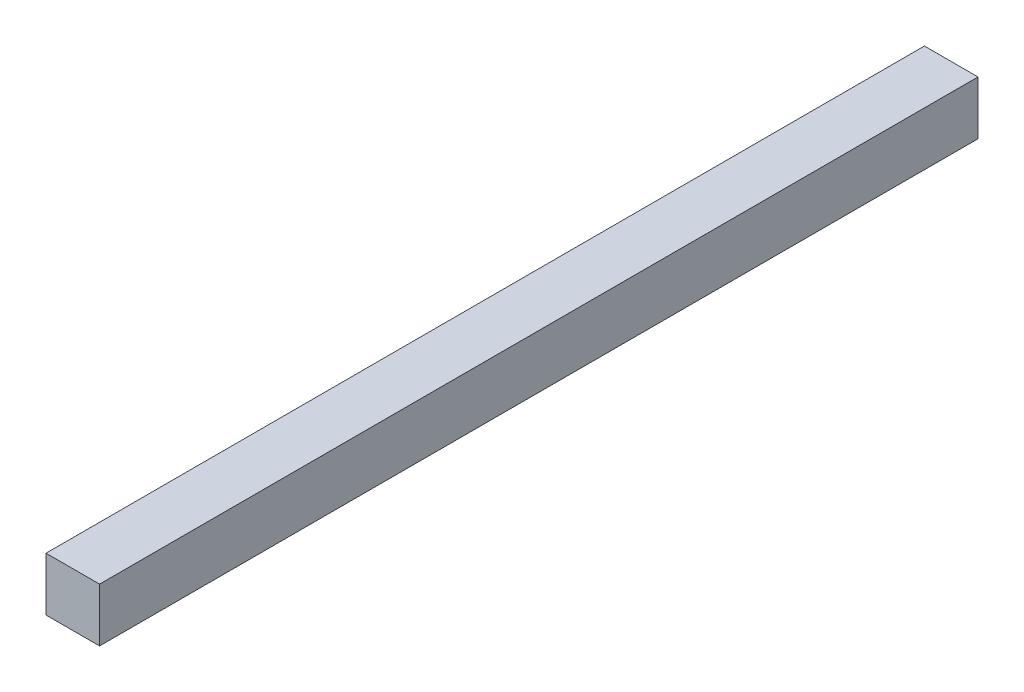
ISO-10303-21;
HEADER;
FILE_DESCRIPTION(('STEP AP214'),'2;1');
FILE_NAME('part.step','',(''),(''),'','','');
FILE_SCHEMA(('AUTOMOTIVE_DESIGN { 1 0 10303 214 1 1 1 1 }'));
ENDSEC;
DATA;
#1=APPLICATION_CONTEXT('core data for automotive mechanical design processes');
#2=APPLICATION_PROTOCOL_DEFINITION('international standard','automotive_design',2000,#1);
#3=PRODUCT_CONTEXT('',#1,'mechanical');
#4=PRODUCT('Part','Part','',(#3));
#5=PRODUCT_RELATED_PRODUCT_CATEGORY('part','',(#4));
#6=PRODUCT_DEFINITION_FORMATION('','',#4);
#7=PRODUCT_DEFINITION_CONTEXT('part definition',#1,'design');
#8=PRODUCT_DEFINITION('design','',#6,#7);
#9=PRODUCT_DEFINITION_SHAPE('','',#8);
#10=(LENGTH_UNIT() NAMED_UNIT(*) SI_UNIT(.MILLI.,.METRE.));
#11=(NAMED_UNIT(*) PLANE_ANGLE_UNIT() SI_UNIT($,.RADIAN.));
#12=(NAMED_UNIT(*) SI_UNIT($,.STERADIAN.) SOLID_ANGLE_UNIT());
#13=UNCERTAINTY_MEASURE_WITH_UNIT(LENGTH_MEASURE(1.E-05),#10,'distance_accuracy_value','');
#14=(GEOMETRIC_REPRESENTATION_CONTEXT(3) GLOBAL_UNCERTAINTY_ASSIGNED_CONTEXT((#13)) GLOBAL_UNIT_ASSIGNED_CONTEXT((#10,
#11,#12)) REPRESENTATION_CONTEXT('',''));
#15=CARTESIAN_POINT('',(0.,0.,0.));
#16=DIRECTION('',(0.,0.,1.));
#17=DIRECTION('',(1.,0.,0.));
#18=AXIS2_PLACEMENT_3D('',#15,#16,#17);
#19=CARTESIAN_POINT('',(0.0254,-0.0254,0.));
#20=DIRECTION('',(-1.,0.,0.));
#21=DIRECTION('',(0.,0.,1.));
#22=AXIS2_PLACEMENT_3D('',#19,#20,#21);
#23=PLANE('',#22);
#24=DIRECTION('',(0.,0.,-1.));
#25=VECTOR('',#24,1.);
#26=CARTESIAN_POINT('',(0.0254,0.,0.));
#27=LINE('',#26,#25);
#28=CARTESIAN_POINT('',(0.0254,0.,0.));
#29=VERTEX_POINT('',#28);
#30=CARTESIAN_POINT('',(0.0254,0.,0.41656));
#31=VERTEX_POINT('',#30);
#32=EDGE_CURVE('E19',#29,#31,#27,.F.);
#33=ORIENTED_EDGE('',*,*,#32,.T.);
#34=DIRECTION('',(0.,1.,0.));
#35=VECTOR('',#34,1.);
#36=CARTESIAN_POINT('',(0.0254,0.,0.41656));
#37=LINE('',#36,#35);
#38=CARTESIAN_POINT('',(0.0254,-0.0254,0.41656));
#39=VERTEX_POINT('',#38);
#40=EDGE_CURVE('E54',#31,#39,#37,.F.);
#41=ORIENTED_EDGE('',*,*,#40,.T.);
#42=DIRECTION('',(0.,0.,1.));
#43=VECTOR('',#42,1.);
#44=CARTESIAN_POINT('',(0.0254,-0.0254,0.));
#45=LINE('',#44,#43);
#46=CARTESIAN_POINT('',(0.0254,-0.0254,0.));
#47=VERTEX_POINT('',#46);
#48=EDGE_CURVE('E75',#39,#47,#45,.F.);
#49=ORIENTED_EDGE('',*,*,#48,.T.);
#50=DIRECTION('',(0.,1.,0.));
#51=VECTOR('',#50,1.);
#52=CARTESIAN_POINT('',(0.0254,0.,0.));
#53=LINE('',#52,#51);
#54=EDGE_CURVE('E57',#29,#47,#53,.F.);
#55=ORIENTED_EDGE('',*,*,#54,.F.);
#56=EDGE_LOOP('',(#33,#41,#49,#55));
#57=FACE_BOUND('',#56,.T.);
#58=ADVANCED_FACE('F16',(#57),#23,.F.);
#59=CARTESIAN_POINT('',(0.0254,0.,0.));
#60=DIRECTION('',(0.,-1.,0.));
#61=DIRECTION('',(0.,0.,-1.));
#62=AXIS2_PLACEMENT_3D('',#59,#60,#61);
#63=PLANE('',#62);
#64=DIRECTION('',(0.,0.,-1.));
#65=VECTOR('',#64,1.);
#66=CARTESIAN_POINT('',(0.,0.,0.));
#67=LINE('',#66,#65);
#68=CARTESIAN_POINT('',(0.,0.,0.));
#69=VERTEX_POINT('',#68);
#70=CARTESIAN_POINT('',(0.,0.,0.41656));
#71=VERTEX_POINT('',#70);
#72=EDGE_CURVE('E72',#69,#71,#67,.F.);
#73=ORIENTED_EDGE('',*,*,#72,.T.);
#74=DIRECTION('',(-1.,0.,0.));
#75=VECTOR('',#74,1.);
#76=CARTESIAN_POINT('',(0.,0.,0.41656));
#77=LINE('',#76,#75);
#78=EDGE_CURVE('E62',#71,#31,#77,.F.);
#79=ORIENTED_EDGE('',*,*,#78,.T.);
#80=ORIENTED_EDGE('',*,*,#32,.F.);
#81=DIRECTION('',(-1.,0.,0.));
#82=VECTOR('',#81,1.);
#83=CARTESIAN_POINT('',(0.,0.,0.));
#84=LINE('',#83,#82);
#85=EDGE_CURVE('E77',#69,#29,#84,.F.);
#86=ORIENTED_EDGE('',*,*,#85,.F.);
#87=EDGE_LOOP('',(#73,#79,#80,#86));
#88=FACE_BOUND('',#87,.T.);
#89=ADVANCED_FACE('F71',(#88),#63,.F.);
#90=CARTESIAN_POINT('',(0.,0.,0.41656));
#91=DIRECTION('',(0.,0.,-1.));
#92=DIRECTION('',(-1.,0.,0.));
#93=AXIS2_PLACEMENT_3D('',#90,#91,#92);
#94=PLANE('',#93);
#95=DIRECTION('',(1.,0.,0.));
#96=VECTOR('',#95,1.);
#97=CARTESIAN_POINT('',(0.,-0.0254,0.41656));
#98=LINE('',#97,#96);
#99=CARTESIAN_POINT('',(0.,-0.0254,0.41656));
#100=VERTEX_POINT('',#99);
#101=EDGE_CURVE('E68',#100,#39,#98,.T.);
#102=ORIENTED_EDGE('',*,*,#101,.T.);
#103=ORIENTED_EDGE('',*,*,#40,.F.);
#104=ORIENTED_EDGE('',*,*,#78,.F.);
#105=DIRECTION('',(0.,1.,0.));
#106=VECTOR('',#105,1.);
#107=CARTESIAN_POINT('',(0.,0.,0.41656));
#108=LINE('',#107,#106);
#109=EDGE_CURVE('E82',#71,#100,#108,.F.);
#110=ORIENTED_EDGE('',*,*,#109,.T.);
#111=EDGE_LOOP('',(#102,#103,#104,#110));
#112=FACE_BOUND('',#111,.T.);
#113=ADVANCED_FACE('F65',(#112),#94,.F.);
#114=CARTESIAN_POINT('',(0.,-0.0254,0.));
#115=DIRECTION('',(0.,1.,0.));
#116=DIRECTION('',(0.,0.,1.));
#117=AXIS2_PLACEMENT_3D('',#114,#115,#116);
#118=PLANE('',#117);
#119=ORIENTED_EDGE('',*,*,#48,.F.);
#120=ORIENTED_EDGE('',*,*,#101,.F.);
#121=DIRECTION('',(0.,0.,-1.));
#122=VECTOR('',#121,1.);
#123=CARTESIAN_POINT('',(0.,-0.0254,0.));
#124=LINE('',#123,#122);
#125=CARTESIAN_POINT('',(0.,-0.0254,0.));
#126=VERTEX_POINT('',#125);
#127=EDGE_CURVE('E25',#100,#126,#124,.T.);
#128=ORIENTED_EDGE('',*,*,#127,.T.);
#129=DIRECTION('',(-1.,0.,0.));
#130=VECTOR('',#129,1.);
#131=CARTESIAN_POINT('',(0.,-0.0254,0.));
#132=LINE('',#131,#130);
#133=EDGE_CURVE('E33',#47,#126,#132,.T.);
#134=ORIENTED_EDGE('',*,*,#133,.F.);
#135=EDGE_LOOP('',(#119,#120,#128,#134));
#136=FACE_BOUND('',#135,.T.);
#137=ADVANCED_FACE('F87',(#136),#118,.F.);
#138=CARTESIAN_POINT('',(0.,0.,0.));
#139=DIRECTION('',(0.,0.,-1.));
#140=DIRECTION('',(-1.,0.,0.));
#141=AXIS2_PLACEMENT_3D('',#138,#139,#140);
#142=PLANE('',#141);
#143=ORIENTED_EDGE('',*,*,#133,.T.);
#144=DIRECTION('',(0.,1.,0.));
#145=VECTOR('',#144,1.);
#146=CARTESIAN_POINT('',(0.,0.,0.));
#147=LINE('',#146,#145);
#148=EDGE_CURVE('E10',#126,#69,#147,.T.);
#149=ORIENTED_EDGE('',*,*,#148,.T.);
#150=ORIENTED_EDGE('',*,*,#85,.T.);
#151=ORIENTED_EDGE('',*,*,#54,.T.);
#152=EDGE_LOOP('',(#143,#149,#150,#151));
#153=FACE_BOUND('',#152,.T.);
#154=ADVANCED_FACE('F90',(#153),#142,.T.);
#155=CARTESIAN_POINT('',(0.,0.,0.));
#156=DIRECTION('',(1.,0.,0.));
#157=DIRECTION('',(0.,0.,-1.));
#158=AXIS2_PLACEMENT_3D('',#155,#156,#157);
#159=PLANE('',#158);
#160=ORIENTED_EDGE('',*,*,#127,.F.);
#161=ORIENTED_EDGE('',*,*,#109,.F.);
#162=ORIENTED_EDGE('',*,*,#72,.F.);
#163=ORIENTED_EDGE('',*,*,#148,.F.);
#164=EDGE_LOOP('',(#160,#161,#162,#163));
#165=FACE_BOUND('',#164,.T.);
#166=ADVANCED_FACE('F89',(#165),#159,.F.);
#167=CLOSED_SHELL('',(#58,#89,#113,#137,#154,#166));
#168=MANIFOLD_SOLID_BREP('B1',#167);
#169=ADVANCED_BREP_SHAPE_REPRESENTATION('',(#18,#168),#14);
#170=SHAPE_DEFINITION_REPRESENTATION(#9,#169);
ENDSEC;
END-ISO-10303-21;
